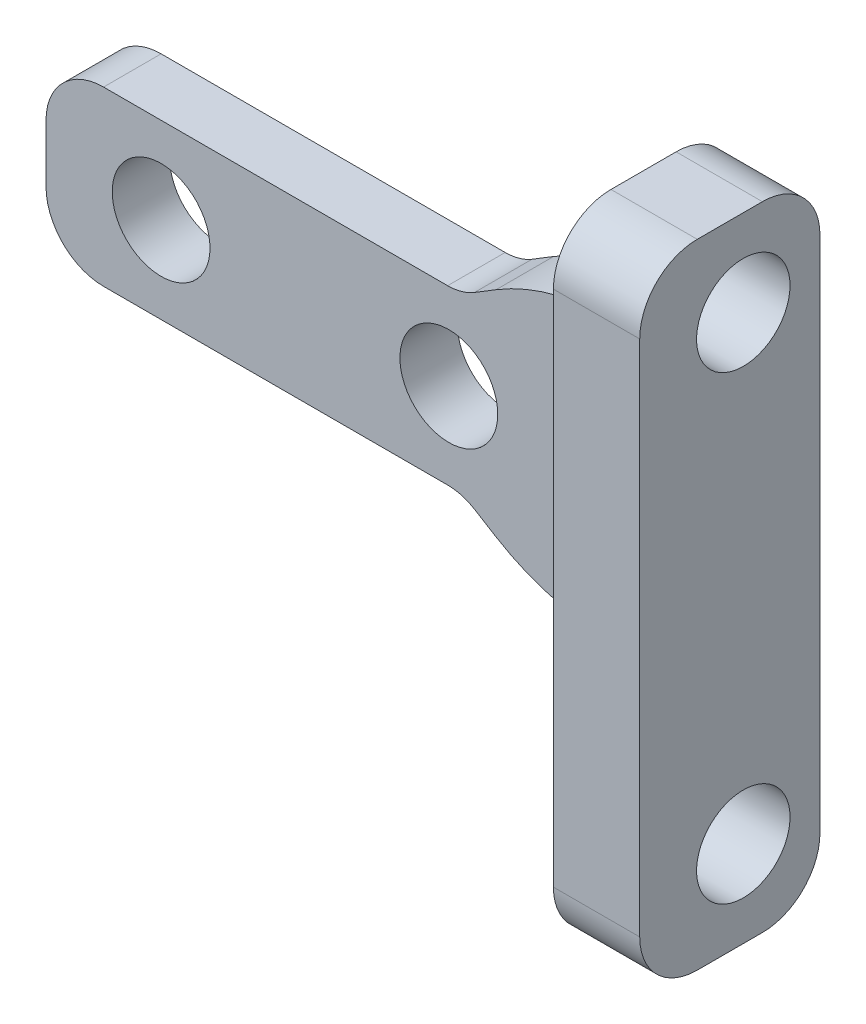
ISO-10303-21;
HEADER;
FILE_DESCRIPTION(('STEP AP214'),'2;1');
FILE_NAME('part.step','',(''),(''),'','','');
FILE_SCHEMA(('AUTOMOTIVE_DESIGN { 1 0 10303 214 1 1 1 1 }'));
ENDSEC;
DATA;
#1=APPLICATION_CONTEXT('core data for automotive mechanical design processes');
#2=APPLICATION_PROTOCOL_DEFINITION('international standard','automotive_design',2000,#1);
#3=PRODUCT_CONTEXT('',#1,'mechanical');
#4=PRODUCT('Part','Part','',(#3));
#5=PRODUCT_RELATED_PRODUCT_CATEGORY('part','',(#4));
#6=PRODUCT_DEFINITION_FORMATION('','',#4);
#7=PRODUCT_DEFINITION_CONTEXT('part definition',#1,'design');
#8=PRODUCT_DEFINITION('design','',#6,#7);
#9=PRODUCT_DEFINITION_SHAPE('','',#8);
#10=(LENGTH_UNIT() NAMED_UNIT(*) SI_UNIT(.MILLI.,.METRE.));
#11=(NAMED_UNIT(*) PLANE_ANGLE_UNIT() SI_UNIT($,.RADIAN.));
#12=(NAMED_UNIT(*) SI_UNIT($,.STERADIAN.) SOLID_ANGLE_UNIT());
#13=UNCERTAINTY_MEASURE_WITH_UNIT(LENGTH_MEASURE(1.E-05),#10,'distance_accuracy_value','');
#14=(GEOMETRIC_REPRESENTATION_CONTEXT(3) GLOBAL_UNCERTAINTY_ASSIGNED_CONTEXT((#13)) GLOBAL_UNIT_ASSIGNED_CONTEXT((#10,
#11,#12)) REPRESENTATION_CONTEXT('',''));
#15=CARTESIAN_POINT('',(0.,0.,0.));
#16=DIRECTION('',(0.,0.,1.));
#17=DIRECTION('',(1.,0.,0.));
#18=AXIS2_PLACEMENT_3D('',#15,#16,#17);
#19=CARTESIAN_POINT('',(0.,0.,2.));
#20=DIRECTION('',(0.,0.,1.));
#21=DIRECTION('',(1.,0.,0.));
#22=AXIS2_PLACEMENT_3D('',#19,#20,#21);
#23=PLANE('',#22);
#24=CARTESIAN_POINT('',(0.,0.,2.));
#25=DIRECTION('',(0.,0.,1.));
#26=DIRECTION('',(1.,0.,0.));
#27=AXIS2_PLACEMENT_3D('',#24,#25,#26);
#28=CIRCLE('',#27,1.7);
#29=CARTESIAN_POINT('',(1.7,0.,2.));
#30=VERTEX_POINT('',#29);
#31=EDGE_CURVE('E392',#30,#30,#28,.T.);
#32=ORIENTED_EDGE('',*,*,#31,.F.);
#33=EDGE_LOOP('',(#32));
#34=FACE_BOUND('',#33,.T.);
#35=CARTESIAN_POINT('',(10.,0.,2.));
#36=DIRECTION('',(0.,0.,1.));
#37=DIRECTION('',(1.,0.,0.));
#38=AXIS2_PLACEMENT_3D('',#35,#36,#37);
#39=CIRCLE('',#38,1.7);
#40=CARTESIAN_POINT('',(11.7,0.,2.));
#41=VERTEX_POINT('',#40);
#42=EDGE_CURVE('E596',#41,#41,#39,.T.);
#43=ORIENTED_EDGE('',*,*,#42,.F.);
#44=EDGE_LOOP('',(#43));
#45=FACE_BOUND('',#44,.T.);
#46=DIRECTION('',(1.,0.,0.));
#47=VECTOR('',#46,1.);
#48=CARTESIAN_POINT('',(0.,-4.82996969322067,2.));
#49=LINE('',#48,#47);
#50=CARTESIAN_POINT('',(15.5807388089609,-4.82996969322067,2.));
#51=VERTEX_POINT('',#50);
#52=CARTESIAN_POINT('',(16.9,-4.82996969322067,2.));
#53=VERTEX_POINT('',#52);
#54=EDGE_CURVE('E280',#51,#53,#49,.T.);
#55=ORIENTED_EDGE('',*,*,#54,.T.);
#56=DIRECTION('',(0.,1.,0.));
#57=VECTOR('',#56,1.);
#58=CARTESIAN_POINT('',(16.9,0.,2.));
#59=LINE('',#58,#57);
#60=CARTESIAN_POINT('',(16.9,4.82996969322067,2.));
#61=VERTEX_POINT('',#60);
#62=EDGE_CURVE('E382',#53,#61,#59,.T.);
#63=ORIENTED_EDGE('',*,*,#62,.T.);
#64=DIRECTION('',(1.,0.,0.));
#65=VECTOR('',#64,1.);
#66=CARTESIAN_POINT('',(0.,4.82996969322067,2.));
#67=LINE('',#66,#65);
#68=CARTESIAN_POINT('',(15.5807388089609,4.82996969322067,2.));
#69=VERTEX_POINT('',#68);
#70=EDGE_CURVE('E448',#69,#61,#67,.T.);
#71=ORIENTED_EDGE('',*,*,#70,.F.);
#72=CARTESIAN_POINT('',(15.5807388089609,-2.7213835882265,2.));
#73=DIRECTION('',(0.,0.,1.));
#74=DIRECTION('',(1.,0.,0.));
#75=AXIS2_PLACEMENT_3D('',#72,#73,#74);
#76=CIRCLE('',#75,7.55135328144716);
#77=CARTESIAN_POINT('',(11.6424452917594,3.72165766211418,2.));
#78=VERTEX_POINT('',#77);
#79=EDGE_CURVE('E458',#78,#69,#76,.F.);
#80=ORIENTED_EDGE('',*,*,#79,.F.);
#81=DIRECTION('',(0.853230011919919,0.521534799183271,0.));
#82=VECTOR('',#81,1.);
#83=CARTESIAN_POINT('',(1.51063094676133,-2.47138956543307,2.));
#84=LINE('',#83,#82);
#85=CARTESIAN_POINT('',(10.8913999184794,3.26258297831384,2.));
#86=VERTEX_POINT('',#85);
#87=EDGE_CURVE('E463',#86,#78,#84,.T.);
#88=ORIENTED_EDGE('',*,*,#87,.F.);
#89=CARTESIAN_POINT('',(9.95833340634536,4.78907814702929,2.));
#90=DIRECTION('',(0.,0.,1.));
#91=DIRECTION('',(1.,0.,0.));
#92=AXIS2_PLACEMENT_3D('',#89,#90,#91);
#93=CIRCLE('',#92,1.78907814702927);
#94=CARTESIAN_POINT('',(9.95833340634536,3.00000000000002,2.));
#95=VERTEX_POINT('',#94);
#96=EDGE_CURVE('E467',#95,#86,#93,.T.);
#97=ORIENTED_EDGE('',*,*,#96,.F.);
#98=DIRECTION('',(-1.,0.,0.));
#99=VECTOR('',#98,1.);
#100=CARTESIAN_POINT('',(0.,3.00000000000002,2.));
#101=LINE('',#100,#99);
#102=CARTESIAN_POINT('',(-2.,3.00000000000002,2.));
#103=VERTEX_POINT('',#102);
#104=EDGE_CURVE('E471',#95,#103,#101,.T.);
#105=ORIENTED_EDGE('',*,*,#104,.T.);
#106=CARTESIAN_POINT('',(-2.,1.00000000000002,2.));
#107=DIRECTION('',(0.,0.,1.));
#108=DIRECTION('',(1.,0.,0.));
#109=AXIS2_PLACEMENT_3D('',#106,#107,#108);
#110=CIRCLE('',#109,2.);
#111=CARTESIAN_POINT('',(-4.,1.00000000000002,2.));
#112=VERTEX_POINT('',#111);
#113=EDGE_CURVE('E368',#103,#112,#110,.T.);
#114=ORIENTED_EDGE('',*,*,#113,.T.);
#115=DIRECTION('',(0.,-1.,0.));
#116=VECTOR('',#115,1.);
#117=CARTESIAN_POINT('',(-4.,0.,2.));
#118=LINE('',#117,#116);
#119=CARTESIAN_POINT('',(-4.,-1.00000000000002,2.));
#120=VERTEX_POINT('',#119);
#121=EDGE_CURVE('E475',#112,#120,#118,.T.);
#122=ORIENTED_EDGE('',*,*,#121,.T.);
#123=CARTESIAN_POINT('',(-2.,-1.00000000000002,2.));
#124=DIRECTION('',(0.,0.,1.));
#125=DIRECTION('',(1.,0.,0.));
#126=AXIS2_PLACEMENT_3D('',#123,#124,#125);
#127=CIRCLE('',#126,2.);
#128=CARTESIAN_POINT('',(-2.,-3.00000000000002,2.));
#129=VERTEX_POINT('',#128);
#130=EDGE_CURVE('E365',#120,#129,#127,.T.);
#131=ORIENTED_EDGE('',*,*,#130,.T.);
#132=DIRECTION('',(1.,0.,0.));
#133=VECTOR('',#132,1.);
#134=CARTESIAN_POINT('',(0.,-3.00000000000002,2.));
#135=LINE('',#134,#133);
#136=CARTESIAN_POINT('',(9.95833340634536,-3.00000000000002,2.));
#137=VERTEX_POINT('',#136);
#138=EDGE_CURVE('E479',#129,#137,#135,.T.);
#139=ORIENTED_EDGE('',*,*,#138,.T.);
#140=CARTESIAN_POINT('',(9.95833340634536,-4.78907814702929,2.));
#141=DIRECTION('',(0.,0.,1.));
#142=DIRECTION('',(1.,0.,0.));
#143=AXIS2_PLACEMENT_3D('',#140,#141,#142);
#144=CIRCLE('',#143,1.78907814702927);
#145=CARTESIAN_POINT('',(10.8913999184794,-3.26258297831384,2.));
#146=VERTEX_POINT('',#145);
#147=EDGE_CURVE('E285',#137,#146,#144,.F.);
#148=ORIENTED_EDGE('',*,*,#147,.T.);
#149=DIRECTION('',(0.853230011919919,-0.521534799183271,0.));
#150=VECTOR('',#149,1.);
#151=CARTESIAN_POINT('',(1.51063094676133,2.47138956543307,2.));
#152=LINE('',#151,#150);
#153=CARTESIAN_POINT('',(11.6424452917594,-3.72165766211418,2.));
#154=VERTEX_POINT('',#153);
#155=EDGE_CURVE('E281',#146,#154,#152,.T.);
#156=ORIENTED_EDGE('',*,*,#155,.T.);
#157=CARTESIAN_POINT('',(15.5807388089609,2.7213835882265,2.));
#158=DIRECTION('',(0.,0.,1.));
#159=DIRECTION('',(1.,0.,0.));
#160=AXIS2_PLACEMENT_3D('',#157,#158,#159);
#161=CIRCLE('',#160,7.55135328144716);
#162=EDGE_CURVE('E268',#154,#51,#161,.T.);
#163=ORIENTED_EDGE('',*,*,#162,.T.);
#164=EDGE_LOOP('',(#55,#63,#71,#80,#88,#97,#105,#114,#122,#131,#139,#148,#156,#163));
#165=FACE_BOUND('',#164,.T.);
#166=ADVANCED_FACE('F51',(#34,#45,#165),#23,.T.);
#167=CARTESIAN_POINT('',(1.51063094676133,2.47138956543307,2.));
#168=DIRECTION('',(0.521534799183271,0.853230011919919,0.));
#169=DIRECTION('',(-0.853230011919919,0.521534799183271,0.));
#170=AXIS2_PLACEMENT_3D('',#167,#168,#169);
#171=PLANE('',#170);
#172=DIRECTION('',(0.853230011919919,-0.521534799183271,0.));
#173=VECTOR('',#172,1.);
#174=CARTESIAN_POINT('',(1.51063094676133,2.47138956543307,0.));
#175=LINE('',#174,#173);
#176=CARTESIAN_POINT('',(10.8913999184794,-3.26258297831384,0.));
#177=VERTEX_POINT('',#176);
#178=CARTESIAN_POINT('',(11.6424452917594,-3.72165766211418,0.));
#179=VERTEX_POINT('',#178);
#180=EDGE_CURVE('E294',#177,#179,#175,.T.);
#181=ORIENTED_EDGE('',*,*,#180,.T.);
#182=DIRECTION('',(0.,0.,-1.));
#183=VECTOR('',#182,1.);
#184=CARTESIAN_POINT('',(11.6424452917594,-3.72165766211418,2.));
#185=LINE('',#184,#183);
#186=EDGE_CURVE('E272',#154,#179,#185,.T.);
#187=ORIENTED_EDGE('',*,*,#186,.F.);
#188=ORIENTED_EDGE('',*,*,#155,.F.);
#189=DIRECTION('',(0.,0.,-1.));
#190=VECTOR('',#189,1.);
#191=CARTESIAN_POINT('',(10.8913999184794,-3.26258297831384,2.));
#192=LINE('',#191,#190);
#193=EDGE_CURVE('E484',#146,#177,#192,.T.);
#194=ORIENTED_EDGE('',*,*,#193,.T.);
#195=EDGE_LOOP('',(#181,#187,#188,#194));
#196=FACE_BOUND('',#195,.T.);
#197=ADVANCED_FACE('F292',(#196),#171,.F.);
#198=CARTESIAN_POINT('',(15.5807388089609,2.7213835882265,2.));
#199=DIRECTION('',(0.,0.,-1.));
#200=DIRECTION('',(-1.,0.,0.));
#201=AXIS2_PLACEMENT_3D('',#198,#199,#200);
#202=CYLINDRICAL_SURFACE('',#201,7.55135328144716);
#203=CARTESIAN_POINT('',(15.5807388089609,2.7213835882265,0.));
#204=DIRECTION('',(0.,0.,1.));
#205=DIRECTION('',(1.,0.,0.));
#206=AXIS2_PLACEMENT_3D('',#203,#204,#205);
#207=CIRCLE('',#206,7.55135328144716);
#208=CARTESIAN_POINT('',(15.5807388089609,-4.82996969322067,0.));
#209=VERTEX_POINT('',#208);
#210=EDGE_CURVE('E486',#179,#209,#207,.T.);
#211=ORIENTED_EDGE('',*,*,#210,.T.);
#212=DIRECTION('',(0.,0.,-1.));
#213=VECTOR('',#212,1.);
#214=CARTESIAN_POINT('',(15.5807388089609,-4.82996969322067,2.));
#215=LINE('',#214,#213);
#216=EDGE_CURVE('E275',#51,#209,#215,.T.);
#217=ORIENTED_EDGE('',*,*,#216,.F.);
#218=ORIENTED_EDGE('',*,*,#162,.F.);
#219=ORIENTED_EDGE('',*,*,#186,.T.);
#220=EDGE_LOOP('',(#211,#217,#218,#219));
#221=FACE_BOUND('',#220,.T.);
#222=ADVANCED_FACE('F270',(#221),#202,.T.);
#223=CARTESIAN_POINT('',(0.,-4.82996969322067,2.));
#224=DIRECTION('',(0.,1.,0.));
#225=DIRECTION('',(0.,0.,1.));
#226=AXIS2_PLACEMENT_3D('',#223,#224,#225);
#227=PLANE('',#226);
#228=DIRECTION('',(1.,0.,0.));
#229=VECTOR('',#228,1.);
#230=CARTESIAN_POINT('',(0.,-4.82996969322067,0.));
#231=LINE('',#230,#229);
#232=CARTESIAN_POINT('',(17.4,-4.82996969322067,0.));
#233=VERTEX_POINT('',#232);
#234=EDGE_CURVE('E490',#209,#233,#231,.T.);
#235=ORIENTED_EDGE('',*,*,#234,.T.);
#236=DIRECTION('',(0.,0.,1.));
#237=VECTOR('',#236,1.);
#238=CARTESIAN_POINT('',(17.4,-4.82996969322067,3.));
#239=LINE('',#238,#237);
#240=CARTESIAN_POINT('',(17.4,-4.82996969322067,2.13397459621556));
#241=VERTEX_POINT('',#240);
#242=EDGE_CURVE('E413',#233,#241,#239,.T.);
#243=ORIENTED_EDGE('',*,*,#242,.T.);
#244=CARTESIAN_POINT('',(16.9,-4.82996969322067,3.));
#245=DIRECTION('',(0.,1.,0.));
#246=DIRECTION('',(0.,0.,1.));
#247=AXIS2_PLACEMENT_3D('',#244,#245,#246);
#248=CIRCLE('',#247,1.);
#249=EDGE_CURVE('E402',#241,#53,#248,.T.);
#250=ORIENTED_EDGE('',*,*,#249,.T.);
#251=ORIENTED_EDGE('',*,*,#54,.F.);
#252=ORIENTED_EDGE('',*,*,#216,.T.);
#253=EDGE_LOOP('',(#235,#243,#250,#251,#252));
#254=FACE_BOUND('',#253,.T.);
#255=ADVANCED_FACE('F708',(#254),#227,.F.);
#256=CARTESIAN_POINT('',(0.,-11.,2.));
#257=DIRECTION('',(0.,-1.,0.));
#258=DIRECTION('',(0.,0.,-1.));
#259=AXIS2_PLACEMENT_3D('',#256,#257,#258);
#260=PLANE('',#259);
#261=DIRECTION('',(0.,0.,-1.));
#262=VECTOR('',#261,1.);
#263=CARTESIAN_POINT('',(17.9,-11.,2.));
#264=LINE('',#263,#262);
#265=CARTESIAN_POINT('',(17.9,-11.,4.26499999999999));
#266=VERTEX_POINT('',#265);
#267=CARTESIAN_POINT('',(17.9,-11.,2.));
#268=VERTEX_POINT('',#267);
#269=EDGE_CURVE('E304',#266,#268,#264,.T.);
#270=ORIENTED_EDGE('',*,*,#269,.T.);
#271=DIRECTION('',(-1.,0.,0.));
#272=VECTOR('',#271,1.);
#273=CARTESIAN_POINT('',(20.9,-11.,2.));
#274=LINE('',#273,#272);
#275=CARTESIAN_POINT('',(20.9,-11.,2.));
#276=VERTEX_POINT('',#275);
#277=EDGE_CURVE('E352',#268,#276,#274,.F.);
#278=ORIENTED_EDGE('',*,*,#277,.T.);
#279=DIRECTION('',(0.,0.,-1.));
#280=VECTOR('',#279,1.);
#281=CARTESIAN_POINT('',(20.9,-11.,2.));
#282=LINE('',#281,#280);
#283=CARTESIAN_POINT('',(20.9,-11.,4.26499999999999));
#284=VERTEX_POINT('',#283);
#285=EDGE_CURVE('E547',#284,#276,#282,.T.);
#286=ORIENTED_EDGE('',*,*,#285,.F.);
#287=DIRECTION('',(-1.,0.,0.));
#288=VECTOR('',#287,1.);
#289=CARTESIAN_POINT('',(0.,-11.,4.26499999999999));
#290=LINE('',#289,#288);
#291=EDGE_CURVE('E348',#284,#266,#290,.T.);
#292=ORIENTED_EDGE('',*,*,#291,.T.);
#293=EDGE_LOOP('',(#270,#278,#286,#292));
#294=FACE_BOUND('',#293,.T.);
#295=ADVANCED_FACE('F555',(#294),#260,.T.);
#296=CARTESIAN_POINT('',(20.9,0.,2.));
#297=DIRECTION('',(-1.,0.,0.));
#298=DIRECTION('',(0.,0.,1.));
#299=AXIS2_PLACEMENT_3D('',#296,#297,#298);
#300=PLANE('',#299);
#301=CARTESIAN_POINT('',(20.9,-8.,2.665));
#302=DIRECTION('',(1.,0.,0.));
#303=DIRECTION('',(0.,0.,-1.));
#304=AXIS2_PLACEMENT_3D('',#301,#302,#303);
#305=CIRCLE('',#304,1.625);
#306=CARTESIAN_POINT('',(20.9,-8.,1.04));
#307=VERTEX_POINT('',#306);
#308=EDGE_CURVE('E388',#307,#307,#305,.T.);
#309=ORIENTED_EDGE('',*,*,#308,.F.);
#310=EDGE_LOOP('',(#309));
#311=FACE_BOUND('',#310,.T.);
#312=CARTESIAN_POINT('',(20.9,8.,2.665));
#313=DIRECTION('',(1.,0.,0.));
#314=DIRECTION('',(0.,0.,-1.));
#315=AXIS2_PLACEMENT_3D('',#312,#313,#314);
#316=CIRCLE('',#315,1.625);
#317=CARTESIAN_POINT('',(20.9,8.,1.04));
#318=VERTEX_POINT('',#317);
#319=EDGE_CURVE('E609',#318,#318,#316,.T.);
#320=ORIENTED_EDGE('',*,*,#319,.F.);
#321=EDGE_LOOP('',(#320));
#322=FACE_BOUND('',#321,.T.);
#323=DIRECTION('',(0.,1.,0.));
#324=VECTOR('',#323,1.);
#325=CARTESIAN_POINT('',(20.9,0.,0.));
#326=LINE('',#325,#324);
#327=CARTESIAN_POINT('',(20.9,-9.,0.));
#328=VERTEX_POINT('',#327);
#329=CARTESIAN_POINT('',(20.9,9.,0.));
#330=VERTEX_POINT('',#329);
#331=EDGE_CURVE('E441',#328,#330,#326,.T.);
#332=ORIENTED_EDGE('',*,*,#331,.T.);
#333=CARTESIAN_POINT('',(20.9,9.,2.));
#334=DIRECTION('',(-1.,0.,0.));
#335=DIRECTION('',(0.,0.,1.));
#336=AXIS2_PLACEMENT_3D('',#333,#334,#335);
#337=CIRCLE('',#336,2.);
#338=CARTESIAN_POINT('',(20.9,11.,2.));
#339=VERTEX_POINT('',#338);
#340=EDGE_CURVE('E345',#330,#339,#337,.F.);
#341=ORIENTED_EDGE('',*,*,#340,.T.);
#342=DIRECTION('',(0.,0.,-1.));
#343=VECTOR('',#342,1.);
#344=CARTESIAN_POINT('',(20.9,11.,2.));
#345=LINE('',#344,#343);
#346=CARTESIAN_POINT('',(20.9,11.,4.26500000000001));
#347=VERTEX_POINT('',#346);
#348=EDGE_CURVE('E543',#347,#339,#345,.T.);
#349=ORIENTED_EDGE('',*,*,#348,.F.);
#350=CARTESIAN_POINT('',(20.9,9.,4.26500000000001));
#351=DIRECTION('',(-1.,0.,0.));
#352=DIRECTION('',(0.,0.,1.));
#353=AXIS2_PLACEMENT_3D('',#350,#351,#352);
#354=CIRCLE('',#353,2.);
#355=CARTESIAN_POINT('',(20.9,9.,6.26500000000001));
#356=VERTEX_POINT('',#355);
#357=EDGE_CURVE('E336',#347,#356,#354,.F.);
#358=ORIENTED_EDGE('',*,*,#357,.T.);
#359=DIRECTION('',(0.,1.,0.));
#360=VECTOR('',#359,1.);
#361=CARTESIAN_POINT('',(20.9,0.,6.265));
#362=LINE('',#361,#360);
#363=CARTESIAN_POINT('',(20.9,-9.,6.26499999999999));
#364=VERTEX_POINT('',#363);
#365=EDGE_CURVE('E582',#364,#356,#362,.T.);
#366=ORIENTED_EDGE('',*,*,#365,.F.);
#367=CARTESIAN_POINT('',(20.9,-9.,4.26499999999999));
#368=DIRECTION('',(-1.,0.,0.));
#369=DIRECTION('',(0.,0.,1.));
#370=AXIS2_PLACEMENT_3D('',#367,#368,#369);
#371=CIRCLE('',#370,2.);
#372=EDGE_CURVE('E339',#364,#284,#371,.F.);
#373=ORIENTED_EDGE('',*,*,#372,.T.);
#374=ORIENTED_EDGE('',*,*,#285,.T.);
#375=CARTESIAN_POINT('',(20.9,-9.,2.));
#376=DIRECTION('',(-1.,0.,0.));
#377=DIRECTION('',(0.,0.,1.));
#378=AXIS2_PLACEMENT_3D('',#375,#376,#377);
#379=CIRCLE('',#378,2.);
#380=EDGE_CURVE('E342',#276,#328,#379,.F.);
#381=ORIENTED_EDGE('',*,*,#380,.T.);
#382=EDGE_LOOP('',(#332,#341,#349,#358,#366,#373,#374,#381));
#383=FACE_BOUND('',#382,.T.);
#384=ADVANCED_FACE('F565',(#311,#322,#383),#300,.F.);
#385=CARTESIAN_POINT('',(0.,11.,2.));
#386=DIRECTION('',(0.,-1.,0.));
#387=DIRECTION('',(0.,0.,-1.));
#388=AXIS2_PLACEMENT_3D('',#385,#386,#387);
#389=PLANE('',#388);
#390=ORIENTED_EDGE('',*,*,#348,.T.);
#391=DIRECTION('',(-1.,0.,0.));
#392=VECTOR('',#391,1.);
#393=CARTESIAN_POINT('',(0.,11.,2.));
#394=LINE('',#393,#392);
#395=CARTESIAN_POINT('',(17.9,11.,2.));
#396=VERTEX_POINT('',#395);
#397=EDGE_CURVE('E301',#339,#396,#394,.T.);
#398=ORIENTED_EDGE('',*,*,#397,.T.);
#399=DIRECTION('',(0.,0.,-1.));
#400=VECTOR('',#399,1.);
#401=CARTESIAN_POINT('',(17.9,11.,2.));
#402=LINE('',#401,#400);
#403=CARTESIAN_POINT('',(17.9,11.,4.26500000000001));
#404=VERTEX_POINT('',#403);
#405=EDGE_CURVE('E540',#404,#396,#402,.T.);
#406=ORIENTED_EDGE('',*,*,#405,.F.);
#407=DIRECTION('',(-1.,0.,0.));
#408=VECTOR('',#407,1.);
#409=CARTESIAN_POINT('',(20.9,11.,4.26500000000001));
#410=LINE('',#409,#408);
#411=EDGE_CURVE('E296',#404,#347,#410,.F.);
#412=ORIENTED_EDGE('',*,*,#411,.T.);
#413=EDGE_LOOP('',(#390,#398,#406,#412));
#414=FACE_BOUND('',#413,.T.);
#415=ADVANCED_FACE('F574',(#414),#389,.F.);
#416=CARTESIAN_POINT('',(17.9,0.,2.));
#417=DIRECTION('',(1.,0.,0.));
#418=DIRECTION('',(0.,0.,-1.));
#419=AXIS2_PLACEMENT_3D('',#416,#417,#418);
#420=PLANE('',#419);
#421=CARTESIAN_POINT('',(17.9,-8.,2.665));
#422=DIRECTION('',(1.,0.,0.));
#423=DIRECTION('',(0.,0.,-1.));
#424=AXIS2_PLACEMENT_3D('',#421,#422,#423);
#425=CIRCLE('',#424,1.625);
#426=CARTESIAN_POINT('',(17.9,-8.,1.04));
#427=VERTEX_POINT('',#426);
#428=EDGE_CURVE('E387',#427,#427,#425,.T.);
#429=ORIENTED_EDGE('',*,*,#428,.T.);
#430=EDGE_LOOP('',(#429));
#431=FACE_BOUND('',#430,.T.);
#432=CARTESIAN_POINT('',(17.9,8.,2.665));
#433=DIRECTION('',(1.,0.,0.));
#434=DIRECTION('',(0.,0.,-1.));
#435=AXIS2_PLACEMENT_3D('',#432,#433,#434);
#436=CIRCLE('',#435,1.625);
#437=CARTESIAN_POINT('',(17.9,8.,1.04));
#438=VERTEX_POINT('',#437);
#439=EDGE_CURVE('E383',#438,#438,#436,.T.);
#440=ORIENTED_EDGE('',*,*,#439,.T.);
#441=EDGE_LOOP('',(#440));
#442=FACE_BOUND('',#441,.T.);
#443=DIRECTION('',(0.,1.,0.));
#444=VECTOR('',#443,1.);
#445=CARTESIAN_POINT('',(17.9,0.,3.));
#446=LINE('',#445,#444);
#447=CARTESIAN_POINT('',(17.9,5.32996969322066,3.));
#448=VERTEX_POINT('',#447);
#449=CARTESIAN_POINT('',(17.9,-5.32996969322068,3.));
#450=VERTEX_POINT('',#449);
#451=EDGE_CURVE('E396',#448,#450,#446,.F.);
#452=ORIENTED_EDGE('',*,*,#451,.T.);
#453=DIRECTION('',(0.,0.,-1.));
#454=VECTOR('',#453,1.);
#455=CARTESIAN_POINT('',(17.9,-5.32996969322068,0.));
#456=LINE('',#455,#454);
#457=CARTESIAN_POINT('',(17.9,-5.32996969322068,0.));
#458=VERTEX_POINT('',#457);
#459=EDGE_CURVE('E409',#450,#458,#456,.T.);
#460=ORIENTED_EDGE('',*,*,#459,.T.);
#461=DIRECTION('',(0.,-1.,0.));
#462=VECTOR('',#461,1.);
#463=CARTESIAN_POINT('',(17.9,0.,0.));
#464=LINE('',#463,#462);
#465=CARTESIAN_POINT('',(17.9,-9.,0.));
#466=VERTEX_POINT('',#465);
#467=EDGE_CURVE('E443',#458,#466,#464,.T.);
#468=ORIENTED_EDGE('',*,*,#467,.T.);
#469=CARTESIAN_POINT('',(17.9,-9.,2.));
#470=DIRECTION('',(1.,0.,0.));
#471=DIRECTION('',(0.,0.,-1.));
#472=AXIS2_PLACEMENT_3D('',#469,#470,#471);
#473=CIRCLE('',#472,2.);
#474=EDGE_CURVE('E317',#466,#268,#473,.F.);
#475=ORIENTED_EDGE('',*,*,#474,.T.);
#476=ORIENTED_EDGE('',*,*,#269,.F.);
#477=CARTESIAN_POINT('',(17.9,-9.,4.26499999999999));
#478=DIRECTION('',(1.,0.,0.));
#479=DIRECTION('',(0.,0.,-1.));
#480=AXIS2_PLACEMENT_3D('',#477,#478,#479);
#481=CIRCLE('',#480,2.);
#482=CARTESIAN_POINT('',(17.9,-9.,6.26499999999999));
#483=VERTEX_POINT('',#482);
#484=EDGE_CURVE('E314',#266,#483,#481,.F.);
#485=ORIENTED_EDGE('',*,*,#484,.T.);
#486=DIRECTION('',(0.,-1.,0.));
#487=VECTOR('',#486,1.);
#488=CARTESIAN_POINT('',(17.9,0.,6.265));
#489=LINE('',#488,#487);
#490=CARTESIAN_POINT('',(17.9,9.,6.26500000000001));
#491=VERTEX_POINT('',#490);
#492=EDGE_CURVE('E487',#491,#483,#489,.T.);
#493=ORIENTED_EDGE('',*,*,#492,.F.);
#494=CARTESIAN_POINT('',(17.9,9.,4.26500000000001));
#495=DIRECTION('',(1.,0.,0.));
#496=DIRECTION('',(0.,0.,-1.));
#497=AXIS2_PLACEMENT_3D('',#494,#495,#496);
#498=CIRCLE('',#497,2.);
#499=EDGE_CURVE('E311',#491,#404,#498,.F.);
#500=ORIENTED_EDGE('',*,*,#499,.T.);
#501=ORIENTED_EDGE('',*,*,#405,.T.);
#502=CARTESIAN_POINT('',(17.9,9.,2.));
#503=DIRECTION('',(1.,0.,0.));
#504=DIRECTION('',(0.,0.,-1.));
#505=AXIS2_PLACEMENT_3D('',#502,#503,#504);
#506=CIRCLE('',#505,2.);
#507=CARTESIAN_POINT('',(17.9,9.,0.));
#508=VERTEX_POINT('',#507);
#509=EDGE_CURVE('E320',#396,#508,#506,.F.);
#510=ORIENTED_EDGE('',*,*,#509,.T.);
#511=CARTESIAN_POINT('',(17.9,5.32996969322066,0.));
#512=VERTEX_POINT('',#511);
#513=EDGE_CURVE('E432',#508,#512,#464,.T.);
#514=ORIENTED_EDGE('',*,*,#513,.T.);
#515=DIRECTION('',(0.,0.,1.));
#516=VECTOR('',#515,1.);
#517=CARTESIAN_POINT('',(17.9,5.32996969322066,2.));
#518=LINE('',#517,#516);
#519=EDGE_CURVE('E405',#512,#448,#518,.T.);
#520=ORIENTED_EDGE('',*,*,#519,.T.);
#521=EDGE_LOOP('',(#452,#460,#468,#475,#476,#485,#493,#500,#501,#510,#514,#520));
#522=FACE_BOUND('',#521,.T.);
#523=ADVANCED_FACE('F438',(#431,#442,#522),#420,.F.);
#524=CARTESIAN_POINT('',(0.,4.82996969322067,2.));
#525=DIRECTION('',(0.,1.,0.));
#526=DIRECTION('',(0.,0.,1.));
#527=AXIS2_PLACEMENT_3D('',#524,#525,#526);
#528=PLANE('',#527);
#529=CARTESIAN_POINT('',(16.9,4.82996969322067,3.));
#530=DIRECTION('',(0.,1.,0.));
#531=DIRECTION('',(0.,0.,1.));
#532=AXIS2_PLACEMENT_3D('',#529,#530,#531);
#533=CIRCLE('',#532,1.);
#534=CARTESIAN_POINT('',(17.4,4.82996969322067,2.13397459621556));
#535=VERTEX_POINT('',#534);
#536=EDGE_CURVE('E399',#61,#535,#533,.F.);
#537=ORIENTED_EDGE('',*,*,#536,.T.);
#538=DIRECTION('',(0.,0.,-1.));
#539=VECTOR('',#538,1.);
#540=CARTESIAN_POINT('',(17.4,4.82996969322067,2.));
#541=LINE('',#540,#539);
#542=CARTESIAN_POINT('',(17.4,4.82996969322067,0.));
#543=VERTEX_POINT('',#542);
#544=EDGE_CURVE('E416',#535,#543,#541,.T.);
#545=ORIENTED_EDGE('',*,*,#544,.T.);
#546=DIRECTION('',(1.,0.,0.));
#547=VECTOR('',#546,1.);
#548=CARTESIAN_POINT('',(0.,4.82996969322067,0.));
#549=LINE('',#548,#547);
#550=CARTESIAN_POINT('',(15.5807388089609,4.82996969322067,0.));
#551=VERTEX_POINT('',#550);
#552=EDGE_CURVE('E436',#551,#543,#549,.T.);
#553=ORIENTED_EDGE('',*,*,#552,.F.);
#554=DIRECTION('',(0.,0.,-1.));
#555=VECTOR('',#554,1.);
#556=CARTESIAN_POINT('',(15.5807388089609,4.82996969322067,2.));
#557=LINE('',#556,#555);
#558=EDGE_CURVE('E537',#69,#551,#557,.T.);
#559=ORIENTED_EDGE('',*,*,#558,.F.);
#560=ORIENTED_EDGE('',*,*,#70,.T.);
#561=EDGE_LOOP('',(#537,#545,#553,#559,#560));
#562=FACE_BOUND('',#561,.T.);
#563=ADVANCED_FACE('F445',(#562),#528,.T.);
#564=CARTESIAN_POINT('',(15.5807388089609,-2.7213835882265,2.));
#565=DIRECTION('',(0.,0.,-1.));
#566=DIRECTION('',(-1.,0.,0.));
#567=AXIS2_PLACEMENT_3D('',#564,#565,#566);
#568=CYLINDRICAL_SURFACE('',#567,7.55135328144716);
#569=CARTESIAN_POINT('',(15.5807388089609,-2.7213835882265,0.));
#570=DIRECTION('',(0.,0.,1.));
#571=DIRECTION('',(1.,0.,0.));
#572=AXIS2_PLACEMENT_3D('',#569,#570,#571);
#573=CIRCLE('',#572,7.55135328144716);
#574=CARTESIAN_POINT('',(11.6424452917594,3.72165766211418,0.));
#575=VERTEX_POINT('',#574);
#576=EDGE_CURVE('E499',#575,#551,#573,.F.);
#577=ORIENTED_EDGE('',*,*,#576,.F.);
#578=DIRECTION('',(0.,0.,-1.));
#579=VECTOR('',#578,1.);
#580=CARTESIAN_POINT('',(11.6424452917594,3.72165766211418,2.));
#581=LINE('',#580,#579);
#582=EDGE_CURVE('E534',#78,#575,#581,.T.);
#583=ORIENTED_EDGE('',*,*,#582,.F.);
#584=ORIENTED_EDGE('',*,*,#79,.T.);
#585=ORIENTED_EDGE('',*,*,#558,.T.);
#586=EDGE_LOOP('',(#577,#583,#584,#585));
#587=FACE_BOUND('',#586,.T.);
#588=ADVANCED_FACE('F638',(#587),#568,.T.);
#589=CARTESIAN_POINT('',(1.51063094676133,-2.47138956543307,2.));
#590=DIRECTION('',(-0.521534799183271,0.853230011919919,0.));
#591=DIRECTION('',(-0.853230011919919,-0.521534799183271,0.));
#592=AXIS2_PLACEMENT_3D('',#589,#590,#591);
#593=PLANE('',#592);
#594=DIRECTION('',(0.853230011919919,0.521534799183271,0.));
#595=VECTOR('',#594,1.);
#596=CARTESIAN_POINT('',(1.51063094676133,-2.47138956543307,0.));
#597=LINE('',#596,#595);
#598=CARTESIAN_POINT('',(10.8913999184794,3.26258297831384,0.));
#599=VERTEX_POINT('',#598);
#600=EDGE_CURVE('E502',#599,#575,#597,.T.);
#601=ORIENTED_EDGE('',*,*,#600,.F.);
#602=DIRECTION('',(0.,0.,-1.));
#603=VECTOR('',#602,1.);
#604=CARTESIAN_POINT('',(10.8913999184794,3.26258297831384,2.));
#605=LINE('',#604,#603);
#606=EDGE_CURVE('E531',#86,#599,#605,.T.);
#607=ORIENTED_EDGE('',*,*,#606,.F.);
#608=ORIENTED_EDGE('',*,*,#87,.T.);
#609=ORIENTED_EDGE('',*,*,#582,.T.);
#610=EDGE_LOOP('',(#601,#607,#608,#609));
#611=FACE_BOUND('',#610,.T.);
#612=ADVANCED_FACE('F675',(#611),#593,.T.);
#613=CARTESIAN_POINT('',(9.95833340634536,4.78907814702929,2.));
#614=DIRECTION('',(0.,0.,-1.));
#615=DIRECTION('',(-1.,0.,0.));
#616=AXIS2_PLACEMENT_3D('',#613,#614,#615);
#617=CYLINDRICAL_SURFACE('',#616,1.78907814702927);
#618=CARTESIAN_POINT('',(9.95833340634536,4.78907814702929,0.));
#619=DIRECTION('',(0.,0.,1.));
#620=DIRECTION('',(1.,0.,0.));
#621=AXIS2_PLACEMENT_3D('',#618,#619,#620);
#622=CIRCLE('',#621,1.78907814702927);
#623=CARTESIAN_POINT('',(9.95833340634536,3.00000000000002,0.));
#624=VERTEX_POINT('',#623);
#625=EDGE_CURVE('E506',#624,#599,#622,.T.);
#626=ORIENTED_EDGE('',*,*,#625,.F.);
#627=DIRECTION('',(0.,0.,-1.));
#628=VECTOR('',#627,1.);
#629=CARTESIAN_POINT('',(9.95833340634536,3.00000000000002,2.));
#630=LINE('',#629,#628);
#631=EDGE_CURVE('E528',#95,#624,#630,.T.);
#632=ORIENTED_EDGE('',*,*,#631,.F.);
#633=ORIENTED_EDGE('',*,*,#96,.T.);
#634=ORIENTED_EDGE('',*,*,#606,.T.);
#635=EDGE_LOOP('',(#626,#632,#633,#634));
#636=FACE_BOUND('',#635,.T.);
#637=ADVANCED_FACE('F671',(#636),#617,.F.);
#638=CARTESIAN_POINT('',(0.,3.00000000000002,2.));
#639=DIRECTION('',(0.,-1.,0.));
#640=DIRECTION('',(0.,0.,-1.));
#641=AXIS2_PLACEMENT_3D('',#638,#639,#640);
#642=PLANE('',#641);
#643=DIRECTION('',(-1.,0.,0.));
#644=VECTOR('',#643,1.);
#645=CARTESIAN_POINT('',(0.,3.00000000000002,0.));
#646=LINE('',#645,#644);
#647=CARTESIAN_POINT('',(-2.,3.00000000000002,0.));
#648=VERTEX_POINT('',#647);
#649=EDGE_CURVE('E510',#624,#648,#646,.T.);
#650=ORIENTED_EDGE('',*,*,#649,.T.);
#651=DIRECTION('',(0.,0.,-1.));
#652=VECTOR('',#651,1.);
#653=CARTESIAN_POINT('',(-2.,3.00000000000002,2.));
#654=LINE('',#653,#652);
#655=EDGE_CURVE('E362',#648,#103,#654,.F.);
#656=ORIENTED_EDGE('',*,*,#655,.T.);
#657=ORIENTED_EDGE('',*,*,#104,.F.);
#658=ORIENTED_EDGE('',*,*,#631,.T.);
#659=EDGE_LOOP('',(#650,#656,#657,#658));
#660=FACE_BOUND('',#659,.T.);
#661=ADVANCED_FACE('F667',(#660),#642,.F.);
#662=CARTESIAN_POINT('',(-4.,0.,2.));
#663=DIRECTION('',(1.,0.,0.));
#664=DIRECTION('',(0.,0.,-1.));
#665=AXIS2_PLACEMENT_3D('',#662,#663,#664);
#666=PLANE('',#665);
#667=ORIENTED_EDGE('',*,*,#121,.F.);
#668=DIRECTION('',(0.,0.,-1.));
#669=VECTOR('',#668,1.);
#670=CARTESIAN_POINT('',(-4.,1.00000000000002,2.));
#671=LINE('',#670,#669);
#672=CARTESIAN_POINT('',(-4.,1.00000000000002,0.));
#673=VERTEX_POINT('',#672);
#674=EDGE_CURVE('E358',#112,#673,#671,.T.);
#675=ORIENTED_EDGE('',*,*,#674,.T.);
#676=DIRECTION('',(0.,-1.,0.));
#677=VECTOR('',#676,1.);
#678=CARTESIAN_POINT('',(-4.,0.,0.));
#679=LINE('',#678,#677);
#680=CARTESIAN_POINT('',(-4.,-1.00000000000002,0.));
#681=VERTEX_POINT('',#680);
#682=EDGE_CURVE('E513',#673,#681,#679,.T.);
#683=ORIENTED_EDGE('',*,*,#682,.T.);
#684=DIRECTION('',(0.,0.,-1.));
#685=VECTOR('',#684,1.);
#686=CARTESIAN_POINT('',(-4.,-1.00000000000002,2.));
#687=LINE('',#686,#685);
#688=EDGE_CURVE('E355',#681,#120,#687,.F.);
#689=ORIENTED_EDGE('',*,*,#688,.T.);
#690=EDGE_LOOP('',(#667,#675,#683,#689));
#691=FACE_BOUND('',#690,.T.);
#692=ADVANCED_FACE('F663',(#691),#666,.F.);
#693=CARTESIAN_POINT('',(0.,-3.00000000000002,2.));
#694=DIRECTION('',(0.,1.,0.));
#695=DIRECTION('',(0.,0.,1.));
#696=AXIS2_PLACEMENT_3D('',#693,#694,#695);
#697=PLANE('',#696);
#698=ORIENTED_EDGE('',*,*,#138,.F.);
#699=DIRECTION('',(0.,0.,-1.));
#700=VECTOR('',#699,1.);
#701=CARTESIAN_POINT('',(-2.,-3.00000000000002,2.));
#702=LINE('',#701,#700);
#703=CARTESIAN_POINT('',(-2.,-3.00000000000002,0.));
#704=VERTEX_POINT('',#703);
#705=EDGE_CURVE('E371',#129,#704,#702,.T.);
#706=ORIENTED_EDGE('',*,*,#705,.T.);
#707=DIRECTION('',(1.,0.,0.));
#708=VECTOR('',#707,1.);
#709=CARTESIAN_POINT('',(0.,-3.00000000000002,0.));
#710=LINE('',#709,#708);
#711=CARTESIAN_POINT('',(9.95833340634536,-3.00000000000002,0.));
#712=VERTEX_POINT('',#711);
#713=EDGE_CURVE('E517',#704,#712,#710,.T.);
#714=ORIENTED_EDGE('',*,*,#713,.T.);
#715=DIRECTION('',(0.,0.,-1.));
#716=VECTOR('',#715,1.);
#717=CARTESIAN_POINT('',(9.95833340634536,-3.00000000000002,2.));
#718=LINE('',#717,#716);
#719=EDGE_CURVE('E524',#137,#712,#718,.T.);
#720=ORIENTED_EDGE('',*,*,#719,.F.);
#721=EDGE_LOOP('',(#698,#706,#714,#720));
#722=FACE_BOUND('',#721,.T.);
#723=ADVANCED_FACE('F659',(#722),#697,.F.);
#724=CARTESIAN_POINT('',(9.95833340634536,-4.78907814702929,2.));
#725=DIRECTION('',(0.,0.,-1.));
#726=DIRECTION('',(-1.,0.,0.));
#727=AXIS2_PLACEMENT_3D('',#724,#725,#726);
#728=CYLINDRICAL_SURFACE('',#727,1.78907814702927);
#729=CARTESIAN_POINT('',(9.95833340634536,-4.78907814702929,0.));
#730=DIRECTION('',(0.,0.,1.));
#731=DIRECTION('',(1.,0.,0.));
#732=AXIS2_PLACEMENT_3D('',#729,#730,#731);
#733=CIRCLE('',#732,1.78907814702927);
#734=EDGE_CURVE('E290',#712,#177,#733,.F.);
#735=ORIENTED_EDGE('',*,*,#734,.T.);
#736=ORIENTED_EDGE('',*,*,#193,.F.);
#737=ORIENTED_EDGE('',*,*,#147,.F.);
#738=ORIENTED_EDGE('',*,*,#719,.T.);
#739=EDGE_LOOP('',(#735,#736,#737,#738));
#740=FACE_BOUND('',#739,.T.);
#741=ADVANCED_FACE('F655',(#740),#728,.F.);
#742=CARTESIAN_POINT('',(0.,0.,0.));
#743=DIRECTION('',(0.,0.,1.));
#744=DIRECTION('',(1.,0.,0.));
#745=AXIS2_PLACEMENT_3D('',#742,#743,#744);
#746=PLANE('',#745);
#747=CARTESIAN_POINT('',(0.,0.,0.));
#748=DIRECTION('',(0.,0.,1.));
#749=DIRECTION('',(1.,0.,0.));
#750=AXIS2_PLACEMENT_3D('',#747,#748,#749);
#751=CIRCLE('',#750,1.7);
#752=CARTESIAN_POINT('',(1.7,0.,0.));
#753=VERTEX_POINT('',#752);
#754=EDGE_CURVE('E602',#753,#753,#751,.T.);
#755=ORIENTED_EDGE('',*,*,#754,.T.);
#756=EDGE_LOOP('',(#755));
#757=FACE_BOUND('',#756,.T.);
#758=CARTESIAN_POINT('',(10.,0.,0.));
#759=DIRECTION('',(0.,0.,1.));
#760=DIRECTION('',(1.,0.,0.));
#761=AXIS2_PLACEMENT_3D('',#758,#759,#760);
#762=CIRCLE('',#761,1.7);
#763=CARTESIAN_POINT('',(11.7,0.,0.));
#764=VERTEX_POINT('',#763);
#765=EDGE_CURVE('E590',#764,#764,#762,.T.);
#766=ORIENTED_EDGE('',*,*,#765,.T.);
#767=EDGE_LOOP('',(#766));
#768=FACE_BOUND('',#767,.T.);
#769=ORIENTED_EDGE('',*,*,#513,.F.);
#770=DIRECTION('',(-1.,0.,0.));
#771=VECTOR('',#770,1.);
#772=CARTESIAN_POINT('',(0.,9.,0.));
#773=LINE('',#772,#771);
#774=EDGE_CURVE('E333',#508,#330,#773,.F.);
#775=ORIENTED_EDGE('',*,*,#774,.T.);
#776=ORIENTED_EDGE('',*,*,#331,.F.);
#777=DIRECTION('',(-1.,0.,0.));
#778=VECTOR('',#777,1.);
#779=CARTESIAN_POINT('',(17.9,-9.,0.));
#780=LINE('',#779,#778);
#781=EDGE_CURVE('E329',#328,#466,#780,.T.);
#782=ORIENTED_EDGE('',*,*,#781,.T.);
#783=ORIENTED_EDGE('',*,*,#467,.F.);
#784=DIRECTION('',(0.707106781186543,-0.707106781186552,0.));
#785=VECTOR('',#784,1.);
#786=CARTESIAN_POINT('',(6.28501515338978,6.2850151533897,0.));
#787=LINE('',#786,#785);
#788=EDGE_CURVE('E419',#458,#233,#787,.F.);
#789=ORIENTED_EDGE('',*,*,#788,.T.);
#790=ORIENTED_EDGE('',*,*,#234,.F.);
#791=ORIENTED_EDGE('',*,*,#210,.F.);
#792=ORIENTED_EDGE('',*,*,#180,.F.);
#793=ORIENTED_EDGE('',*,*,#734,.F.);
#794=ORIENTED_EDGE('',*,*,#713,.F.);
#795=CARTESIAN_POINT('',(-2.,-1.00000000000002,0.));
#796=DIRECTION('',(0.,0.,1.));
#797=DIRECTION('',(1.,0.,0.));
#798=AXIS2_PLACEMENT_3D('',#795,#796,#797);
#799=CIRCLE('',#798,2.);
#800=EDGE_CURVE('E323',#704,#681,#799,.F.);
#801=ORIENTED_EDGE('',*,*,#800,.T.);
#802=ORIENTED_EDGE('',*,*,#682,.F.);
#803=CARTESIAN_POINT('',(-2.,1.00000000000002,0.));
#804=DIRECTION('',(0.,0.,1.));
#805=DIRECTION('',(1.,0.,0.));
#806=AXIS2_PLACEMENT_3D('',#803,#804,#805);
#807=CIRCLE('',#806,2.);
#808=EDGE_CURVE('E326',#673,#648,#807,.F.);
#809=ORIENTED_EDGE('',*,*,#808,.T.);
#810=ORIENTED_EDGE('',*,*,#649,.F.);
#811=ORIENTED_EDGE('',*,*,#625,.T.);
#812=ORIENTED_EDGE('',*,*,#600,.T.);
#813=ORIENTED_EDGE('',*,*,#576,.T.);
#814=ORIENTED_EDGE('',*,*,#552,.T.);
#815=DIRECTION('',(0.707106781186552,0.707106781186543,0.));
#816=VECTOR('',#815,1.);
#817=CARTESIAN_POINT('',(6.28501515338954,-6.28501515338963,0.));
#818=LINE('',#817,#816);
#819=EDGE_CURVE('E61',#543,#512,#818,.T.);
#820=ORIENTED_EDGE('',*,*,#819,.T.);
#821=EDGE_LOOP('',(#769,#775,#776,#782,#783,#789,#790,#791,#792,#793,#794,#801,#802,#809,#810,
#811,#812,#813,#814,#820));
#822=FACE_BOUND('',#821,.T.);
#823=ADVANCED_FACE('F431',(#757,#768,#822),#746,.F.);
#824=CARTESIAN_POINT('',(25.,7.99999999999999,6.26500000000001));
#825=DIRECTION('',(0.,0.,1.));
#826=DIRECTION('',(0.,-1.,0.));
#827=AXIS2_PLACEMENT_3D('',#824,#825,#826);
#828=PLANE('',#827);
#829=ORIENTED_EDGE('',*,*,#492,.T.);
#830=DIRECTION('',(-1.,0.,0.));
#831=VECTOR('',#830,1.);
#832=CARTESIAN_POINT('',(25.,-9.,6.26499999999999));
#833=LINE('',#832,#831);
#834=EDGE_CURVE('E379',#483,#364,#833,.F.);
#835=ORIENTED_EDGE('',*,*,#834,.T.);
#836=ORIENTED_EDGE('',*,*,#365,.T.);
#837=DIRECTION('',(-1.,0.,0.));
#838=VECTOR('',#837,1.);
#839=CARTESIAN_POINT('',(17.9,9.,6.26500000000001));
#840=LINE('',#839,#838);
#841=EDGE_CURVE('E375',#356,#491,#840,.T.);
#842=ORIENTED_EDGE('',*,*,#841,.T.);
#843=EDGE_LOOP('',(#829,#835,#836,#842));
#844=FACE_BOUND('',#843,.T.);
#845=ADVANCED_FACE('F586',(#844),#828,.T.);
#846=CARTESIAN_POINT('',(10.,0.,2.));
#847=DIRECTION('',(0.,0.,1.));
#848=DIRECTION('',(1.,0.,0.));
#849=AXIS2_PLACEMENT_3D('',#846,#847,#848);
#850=CYLINDRICAL_SURFACE('',#849,1.7);
#851=ORIENTED_EDGE('',*,*,#765,.F.);
#852=EDGE_LOOP('',(#851));
#853=FACE_BOUND('',#852,.T.);
#854=ORIENTED_EDGE('',*,*,#42,.T.);
#855=EDGE_LOOP('',(#854));
#856=FACE_BOUND('',#855,.T.);
#857=ADVANCED_FACE('F792',(#853,#856),#850,.F.);
#858=CARTESIAN_POINT('',(0.,0.,2.));
#859=DIRECTION('',(0.,0.,1.));
#860=DIRECTION('',(1.,0.,0.));
#861=AXIS2_PLACEMENT_3D('',#858,#859,#860);
#862=CYLINDRICAL_SURFACE('',#861,1.7);
#863=ORIENTED_EDGE('',*,*,#754,.F.);
#864=EDGE_LOOP('',(#863));
#865=FACE_BOUND('',#864,.T.);
#866=ORIENTED_EDGE('',*,*,#31,.T.);
#867=EDGE_LOOP('',(#866));
#868=FACE_BOUND('',#867,.T.);
#869=ADVANCED_FACE('F737',(#865,#868),#862,.F.);
#870=CARTESIAN_POINT('',(0.,9.,2.));
#871=DIRECTION('',(-1.,0.,0.));
#872=DIRECTION('',(0.,0.,1.));
#873=AXIS2_PLACEMENT_3D('',#870,#871,#872);
#874=CYLINDRICAL_SURFACE('',#873,2.);
#875=ORIENTED_EDGE('',*,*,#340,.F.);
#876=ORIENTED_EDGE('',*,*,#774,.F.);
#877=ORIENTED_EDGE('',*,*,#509,.F.);
#878=ORIENTED_EDGE('',*,*,#397,.F.);
#879=EDGE_LOOP('',(#875,#876,#877,#878));
#880=FACE_BOUND('',#879,.T.);
#881=ADVANCED_FACE('F569',(#880),#874,.T.);
#882=CARTESIAN_POINT('',(0.,-9.,2.));
#883=DIRECTION('',(1.,0.,0.));
#884=DIRECTION('',(0.,0.,-1.));
#885=AXIS2_PLACEMENT_3D('',#882,#883,#884);
#886=CYLINDRICAL_SURFACE('',#885,2.);
#887=ORIENTED_EDGE('',*,*,#380,.F.);
#888=ORIENTED_EDGE('',*,*,#277,.F.);
#889=ORIENTED_EDGE('',*,*,#474,.F.);
#890=ORIENTED_EDGE('',*,*,#781,.F.);
#891=EDGE_LOOP('',(#887,#888,#889,#890));
#892=FACE_BOUND('',#891,.T.);
#893=ADVANCED_FACE('F561',(#892),#886,.T.);
#894=CARTESIAN_POINT('',(-2.,1.00000000000002,2.));
#895=DIRECTION('',(0.,0.,-1.));
#896=DIRECTION('',(-1.,0.,0.));
#897=AXIS2_PLACEMENT_3D('',#894,#895,#896);
#898=CYLINDRICAL_SURFACE('',#897,2.);
#899=ORIENTED_EDGE('',*,*,#113,.F.);
#900=ORIENTED_EDGE('',*,*,#655,.F.);
#901=ORIENTED_EDGE('',*,*,#808,.F.);
#902=ORIENTED_EDGE('',*,*,#674,.F.);
#903=EDGE_LOOP('',(#899,#900,#901,#902));
#904=FACE_BOUND('',#903,.T.);
#905=ADVANCED_FACE('F696',(#904),#898,.T.);
#906=CARTESIAN_POINT('',(-2.,-1.00000000000002,2.));
#907=DIRECTION('',(0.,0.,-1.));
#908=DIRECTION('',(-1.,0.,0.));
#909=AXIS2_PLACEMENT_3D('',#906,#907,#908);
#910=CYLINDRICAL_SURFACE('',#909,2.);
#911=ORIENTED_EDGE('',*,*,#130,.F.);
#912=ORIENTED_EDGE('',*,*,#688,.F.);
#913=ORIENTED_EDGE('',*,*,#800,.F.);
#914=ORIENTED_EDGE('',*,*,#705,.F.);
#915=EDGE_LOOP('',(#911,#912,#913,#914));
#916=FACE_BOUND('',#915,.T.);
#917=ADVANCED_FACE('F704',(#916),#910,.T.);
#918=CARTESIAN_POINT('',(0.,-9.,4.26499999999999));
#919=DIRECTION('',(-1.,0.,0.));
#920=DIRECTION('',(0.,0.,1.));
#921=AXIS2_PLACEMENT_3D('',#918,#919,#920);
#922=CYLINDRICAL_SURFACE('',#921,2.);
#923=ORIENTED_EDGE('',*,*,#372,.F.);
#924=ORIENTED_EDGE('',*,*,#834,.F.);
#925=ORIENTED_EDGE('',*,*,#484,.F.);
#926=ORIENTED_EDGE('',*,*,#291,.F.);
#927=EDGE_LOOP('',(#923,#924,#925,#926));
#928=FACE_BOUND('',#927,.T.);
#929=ADVANCED_FACE('F726',(#928),#922,.T.);
#930=CARTESIAN_POINT('',(25.,9.,4.26500000000001));
#931=DIRECTION('',(1.,0.,0.));
#932=DIRECTION('',(0.,0.,-1.));
#933=AXIS2_PLACEMENT_3D('',#930,#931,#932);
#934=CYLINDRICAL_SURFACE('',#933,2.);
#935=ORIENTED_EDGE('',*,*,#357,.F.);
#936=ORIENTED_EDGE('',*,*,#411,.F.);
#937=ORIENTED_EDGE('',*,*,#499,.F.);
#938=ORIENTED_EDGE('',*,*,#841,.F.);
#939=EDGE_LOOP('',(#935,#936,#937,#938));
#940=FACE_BOUND('',#939,.T.);
#941=ADVANCED_FACE('F578',(#940),#934,.T.);
#942=CARTESIAN_POINT('',(13.4,8.,2.665));
#943=DIRECTION('',(1.,0.,0.));
#944=DIRECTION('',(0.,0.,-1.));
#945=AXIS2_PLACEMENT_3D('',#942,#943,#944);
#946=CYLINDRICAL_SURFACE('',#945,1.625);
#947=ORIENTED_EDGE('',*,*,#319,.T.);
#948=EDGE_LOOP('',(#947));
#949=FACE_BOUND('',#948,.T.);
#950=ORIENTED_EDGE('',*,*,#439,.F.);
#951=EDGE_LOOP('',(#950));
#952=FACE_BOUND('',#951,.T.);
#953=ADVANCED_FACE('F625',(#949,#952),#946,.F.);
#954=CARTESIAN_POINT('',(13.4,-8.,2.665));
#955=DIRECTION('',(1.,0.,0.));
#956=DIRECTION('',(0.,0.,-1.));
#957=AXIS2_PLACEMENT_3D('',#954,#955,#956);
#958=CYLINDRICAL_SURFACE('',#957,1.625);
#959=ORIENTED_EDGE('',*,*,#308,.T.);
#960=EDGE_LOOP('',(#959));
#961=FACE_BOUND('',#960,.T.);
#962=ORIENTED_EDGE('',*,*,#428,.F.);
#963=EDGE_LOOP('',(#962));
#964=FACE_BOUND('',#963,.T.);
#965=ADVANCED_FACE('F617',(#961,#964),#958,.F.);
#966=CARTESIAN_POINT('',(16.9,0.,3.));
#967=DIRECTION('',(0.,1.,0.));
#968=DIRECTION('',(0.,0.,1.));
#969=AXIS2_PLACEMENT_3D('',#966,#967,#968);
#970=CYLINDRICAL_SURFACE('',#969,1.);
#971=ORIENTED_EDGE('',*,*,#249,.F.);
#972=CARTESIAN_POINT('',(16.9,-4.32996969322066,3.));
#973=DIRECTION('',(-0.707106781186552,-0.707106781186542,0.));
#974=DIRECTION('',(-0.707106781186543,0.707106781186552,0.));
#975=AXIS2_PLACEMENT_3D('',#972,#973,#974);
#976=ELLIPSE('',#975,1.41421356237311,1.);
#977=EDGE_CURVE('E422',#241,#450,#976,.T.);
#978=ORIENTED_EDGE('',*,*,#977,.T.);
#979=ORIENTED_EDGE('',*,*,#451,.F.);
#980=CARTESIAN_POINT('',(16.9,4.32996969322067,3.));
#981=DIRECTION('',(0.707106781186543,-0.707106781186552,0.));
#982=DIRECTION('',(0.707106781186552,0.707106781186543,0.));
#983=AXIS2_PLACEMENT_3D('',#980,#981,#982);
#984=ELLIPSE('',#983,1.41421356237309,1.);
#985=EDGE_CURVE('E11',#448,#535,#984,.F.);
#986=ORIENTED_EDGE('',*,*,#985,.T.);
#987=ORIENTED_EDGE('',*,*,#536,.F.);
#988=ORIENTED_EDGE('',*,*,#62,.F.);
#989=EDGE_LOOP('',(#971,#978,#979,#986,#987,#988));
#990=FACE_BOUND('',#989,.T.);
#991=ADVANCED_FACE('F451',(#990),#970,.F.);
#992=CARTESIAN_POINT('',(17.9,-5.32996969322068,2.));
#993=DIRECTION('',(-0.707106781186552,-0.707106781186542,0.));
#994=DIRECTION('',(0.,0.,1.));
#995=AXIS2_PLACEMENT_3D('',#992,#993,#994);
#996=PLANE('',#995);
#997=ORIENTED_EDGE('',*,*,#977,.F.);
#998=ORIENTED_EDGE('',*,*,#242,.F.);
#999=ORIENTED_EDGE('',*,*,#788,.F.);
#1000=ORIENTED_EDGE('',*,*,#459,.F.);
#1001=EDGE_LOOP('',(#997,#998,#999,#1000));
#1002=FACE_BOUND('',#1001,.T.);
#1003=ADVANCED_FACE('F712',(#1002),#996,.T.);
#1004=CARTESIAN_POINT('',(17.4,4.82996969322067,2.));
#1005=DIRECTION('',(0.707106781186543,-0.707106781186552,0.));
#1006=DIRECTION('',(0.,0.,-1.));
#1007=AXIS2_PLACEMENT_3D('',#1004,#1005,#1006);
#1008=PLANE('',#1007);
#1009=ORIENTED_EDGE('',*,*,#985,.F.);
#1010=ORIENTED_EDGE('',*,*,#519,.F.);
#1011=ORIENTED_EDGE('',*,*,#819,.F.);
#1012=ORIENTED_EDGE('',*,*,#544,.F.);
#1013=EDGE_LOOP('',(#1009,#1010,#1011,#1012));
#1014=FACE_BOUND('',#1013,.T.);
#1015=ADVANCED_FACE('F54',(#1014),#1008,.F.);
#1016=CLOSED_SHELL('',(#166,#197,#222,#255,#295,#384,#415,#523,#563,#588,#612,#637,#661,#692,
#723,#741,#823,#845,#857,#869,#881,#893,#905,#917,#929,#941,#953,#965,#991,#1003,#1015));
#1017=MANIFOLD_SOLID_BREP('B2',#1016);
#1018=ADVANCED_BREP_SHAPE_REPRESENTATION('',(#18,#1017),#14);
#1019=SHAPE_DEFINITION_REPRESENTATION(#9,#1018);
ENDSEC;
END-ISO-10303-21;
